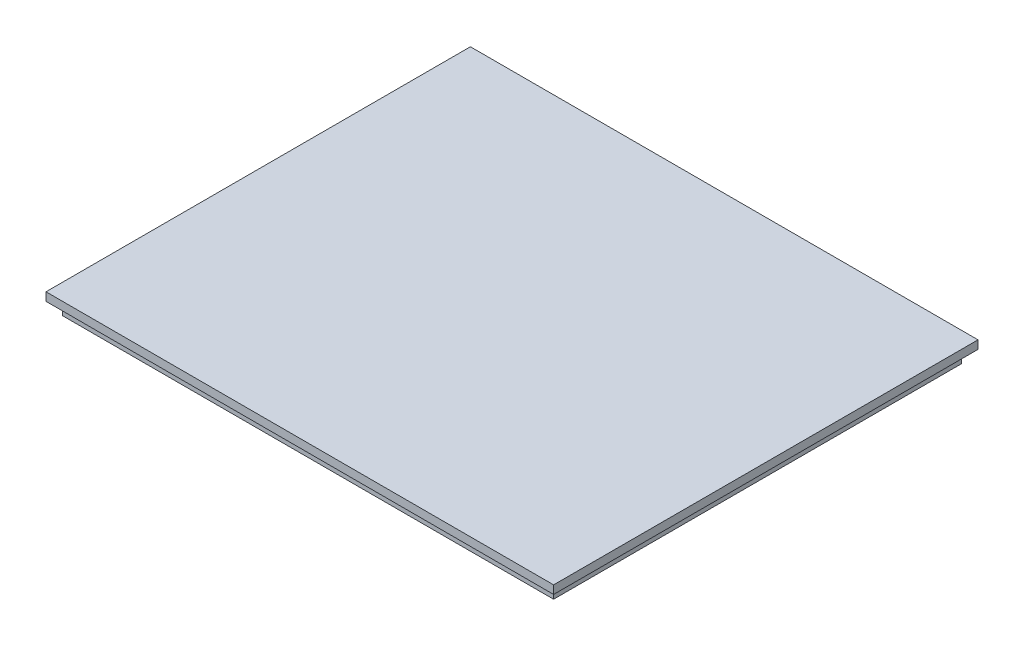
ISO-10303-21;
HEADER;
FILE_DESCRIPTION(('STEP AP214'),'2;1');
FILE_NAME('part.step','',(''),(''),'','','');
FILE_SCHEMA(('AUTOMOTIVE_DESIGN { 1 0 10303 214 1 1 1 1 }'));
ENDSEC;
DATA;
#1=APPLICATION_CONTEXT('core data for automotive mechanical design processes');
#2=APPLICATION_PROTOCOL_DEFINITION('international standard','automotive_design',2000,#1);
#3=PRODUCT_CONTEXT('',#1,'mechanical');
#4=PRODUCT('Part','Part','',(#3));
#5=PRODUCT_RELATED_PRODUCT_CATEGORY('part','',(#4));
#6=PRODUCT_DEFINITION_FORMATION('','',#4);
#7=PRODUCT_DEFINITION_CONTEXT('part definition',#1,'design');
#8=PRODUCT_DEFINITION('design','',#6,#7);
#9=PRODUCT_DEFINITION_SHAPE('','',#8);
#10=(LENGTH_UNIT() NAMED_UNIT(*) SI_UNIT(.MILLI.,.METRE.));
#11=(NAMED_UNIT(*) PLANE_ANGLE_UNIT() SI_UNIT($,.RADIAN.));
#12=(NAMED_UNIT(*) SI_UNIT($,.STERADIAN.) SOLID_ANGLE_UNIT());
#13=UNCERTAINTY_MEASURE_WITH_UNIT(LENGTH_MEASURE(1.E-05),#10,'distance_accuracy_value','');
#14=(GEOMETRIC_REPRESENTATION_CONTEXT(3) GLOBAL_UNCERTAINTY_ASSIGNED_CONTEXT((#13)) GLOBAL_UNIT_ASSIGNED_CONTEXT((#10,
#11,#12)) REPRESENTATION_CONTEXT('',''));
#15=CARTESIAN_POINT('',(0.,0.,0.));
#16=DIRECTION('',(0.,0.,1.));
#17=DIRECTION('',(1.,0.,0.));
#18=AXIS2_PLACEMENT_3D('',#15,#16,#17);
#19=CARTESIAN_POINT('',(67.4766734279919,88.2232812478183,-28.1135902636917));
#20=DIRECTION('',(0.,0.,1.));
#21=DIRECTION('',(1.,0.,0.));
#22=AXIS2_PLACEMENT_3D('',#19,#20,#21);
#23=PLANE('',#22);
#24=DIRECTION('',(-1.,0.,0.));
#25=VECTOR('',#24,1.);
#26=CARTESIAN_POINT('',(-54.5233265720081,85.2232812478183,-28.1135902636917));
#27=LINE('',#26,#25);
#28=CARTESIAN_POINT('',(67.4766734279919,85.2232812478183,-28.1135902636917));
#29=VERTEX_POINT('',#28);
#30=CARTESIAN_POINT('',(-54.5233265720081,85.2232812478183,-28.1135902636917));
#31=VERTEX_POINT('',#30);
#32=EDGE_CURVE('E176',#29,#31,#27,.T.);
#33=ORIENTED_EDGE('',*,*,#32,.F.);
#34=DIRECTION('',(0.,-1.,0.));
#35=VECTOR('',#34,1.);
#36=CARTESIAN_POINT('',(67.4766734279919,88.2232812478183,-28.1135902636917));
#37=LINE('',#36,#35);
#38=CARTESIAN_POINT('',(67.4766734279919,83.2232812478183,-28.1135902636917));
#39=VERTEX_POINT('',#38);
#40=EDGE_CURVE('E197',#29,#39,#37,.T.);
#41=ORIENTED_EDGE('',*,*,#40,.T.);
#42=DIRECTION('',(-1.,0.,0.));
#43=VECTOR('',#42,1.);
#44=CARTESIAN_POINT('',(67.4766734279919,83.2232812478183,-28.1135902636917));
#45=LINE('',#44,#43);
#46=CARTESIAN_POINT('',(-54.5233265720081,83.2232812478183,-28.1135902636917));
#47=VERTEX_POINT('',#46);
#48=EDGE_CURVE('E211',#39,#47,#45,.T.);
#49=ORIENTED_EDGE('',*,*,#48,.T.);
#50=DIRECTION('',(0.,-1.,0.));
#51=VECTOR('',#50,1.);
#52=CARTESIAN_POINT('',(-54.5233265720081,88.2232812478183,-28.1135902636917));
#53=LINE('',#52,#51);
#54=EDGE_CURVE('E11',#31,#47,#53,.T.);
#55=ORIENTED_EDGE('',*,*,#54,.F.);
#56=EDGE_LOOP('',(#33,#41,#49,#55));
#57=FACE_BOUND('',#56,.T.);
#58=ADVANCED_FACE('F39',(#57),#23,.F.);
#59=CARTESIAN_POINT('',(-54.5233265720081,88.2232812478183,-28.1135902636917));
#60=DIRECTION('',(1.,0.,0.));
#61=DIRECTION('',(0.,0.,-1.));
#62=AXIS2_PLACEMENT_3D('',#59,#60,#61);
#63=PLANE('',#62);
#64=DIRECTION('',(0.,0.,1.));
#65=VECTOR('',#64,1.);
#66=CARTESIAN_POINT('',(-54.5233265720081,85.2232812478183,-28.1135902636917));
#67=LINE('',#66,#65);
#68=CARTESIAN_POINT('',(-54.5233265720081,85.2232812478183,73.8864097363083));
#69=VERTEX_POINT('',#68);
#70=EDGE_CURVE('E173',#31,#69,#67,.T.);
#71=ORIENTED_EDGE('',*,*,#70,.F.);
#72=ORIENTED_EDGE('',*,*,#54,.T.);
#73=DIRECTION('',(0.,0.,1.));
#74=VECTOR('',#73,1.);
#75=CARTESIAN_POINT('',(-54.5233265720081,83.2232812478183,-28.1135902636917));
#76=LINE('',#75,#74);
#77=CARTESIAN_POINT('',(-54.5233265720081,83.2232812478183,73.8864097363083));
#78=VERTEX_POINT('',#77);
#79=EDGE_CURVE('E193',#47,#78,#76,.T.);
#80=ORIENTED_EDGE('',*,*,#79,.T.);
#81=DIRECTION('',(0.,-1.,0.));
#82=VECTOR('',#81,1.);
#83=CARTESIAN_POINT('',(-54.5233265720081,88.2232812478183,73.8864097363083));
#84=LINE('',#83,#82);
#85=EDGE_CURVE('E47',#69,#78,#84,.T.);
#86=ORIENTED_EDGE('',*,*,#85,.F.);
#87=EDGE_LOOP('',(#71,#72,#80,#86));
#88=FACE_BOUND('',#87,.T.);
#89=ADVANCED_FACE('F191',(#88),#63,.F.);
#90=CARTESIAN_POINT('',(-54.5233265720081,88.2232812478183,73.8864097363083));
#91=DIRECTION('',(0.,0.,-1.));
#92=DIRECTION('',(-1.,0.,0.));
#93=AXIS2_PLACEMENT_3D('',#90,#91,#92);
#94=PLANE('',#93);
#95=DIRECTION('',(1.,0.,0.));
#96=VECTOR('',#95,1.);
#97=CARTESIAN_POINT('',(-54.5233265720081,85.2232812478183,73.8864097363083));
#98=LINE('',#97,#96);
#99=CARTESIAN_POINT('',(67.4766734279919,85.2232812478183,73.8864097363083));
#100=VERTEX_POINT('',#99);
#101=EDGE_CURVE('E54',#69,#100,#98,.T.);
#102=ORIENTED_EDGE('',*,*,#101,.F.);
#103=ORIENTED_EDGE('',*,*,#85,.T.);
#104=DIRECTION('',(1.,0.,0.));
#105=VECTOR('',#104,1.);
#106=CARTESIAN_POINT('',(-54.5233265720081,83.2232812478183,73.8864097363083));
#107=LINE('',#106,#105);
#108=CARTESIAN_POINT('',(67.4766734279919,83.2232812478183,73.8864097363083));
#109=VERTEX_POINT('',#108);
#110=EDGE_CURVE('E206',#78,#109,#107,.T.);
#111=ORIENTED_EDGE('',*,*,#110,.T.);
#112=DIRECTION('',(0.,-1.,0.));
#113=VECTOR('',#112,1.);
#114=CARTESIAN_POINT('',(67.4766734279919,88.2232812478183,73.8864097363083));
#115=LINE('',#114,#113);
#116=EDGE_CURVE('E187',#100,#109,#115,.T.);
#117=ORIENTED_EDGE('',*,*,#116,.F.);
#118=EDGE_LOOP('',(#102,#103,#111,#117));
#119=FACE_BOUND('',#118,.T.);
#120=ADVANCED_FACE('F184',(#119),#94,.F.);
#121=CARTESIAN_POINT('',(67.4766734279919,88.2232812478183,73.8864097363083));
#122=DIRECTION('',(-1.,0.,0.));
#123=DIRECTION('',(0.,0.,1.));
#124=AXIS2_PLACEMENT_3D('',#121,#122,#123);
#125=PLANE('',#124);
#126=DIRECTION('',(0.,0.,-1.));
#127=VECTOR('',#126,1.);
#128=CARTESIAN_POINT('',(67.4766734279919,85.2232812478183,-28.1135902636917));
#129=LINE('',#128,#127);
#130=EDGE_CURVE('E189',#100,#29,#129,.T.);
#131=ORIENTED_EDGE('',*,*,#130,.F.);
#132=ORIENTED_EDGE('',*,*,#116,.T.);
#133=DIRECTION('',(0.,0.,-1.));
#134=VECTOR('',#133,1.);
#135=CARTESIAN_POINT('',(67.4766734279919,83.2232812478183,73.8864097363083));
#136=LINE('',#135,#134);
#137=EDGE_CURVE('E202',#109,#39,#136,.T.);
#138=ORIENTED_EDGE('',*,*,#137,.T.);
#139=ORIENTED_EDGE('',*,*,#40,.F.);
#140=EDGE_LOOP('',(#131,#132,#138,#139));
#141=FACE_BOUND('',#140,.T.);
#142=ADVANCED_FACE('F372',(#141),#125,.F.);
#143=CARTESIAN_POINT('',(0.,80.2232812478183,0.));
#144=DIRECTION('',(0.,-1.,0.));
#145=DIRECTION('',(0.,0.,-1.));
#146=AXIS2_PLACEMENT_3D('',#143,#144,#145);
#147=PLANE('',#146);
#148=DIRECTION('',(-1.,0.,0.));
#149=VECTOR('',#148,1.);
#150=CARTESIAN_POINT('',(67.4776734279919,80.2232812478183,-13.1135902636917));
#151=LINE('',#150,#149);
#152=CARTESIAN_POINT('',(-50.5233265720081,80.2232812478183,-13.1135902636917));
#153=VERTEX_POINT('',#152);
#154=CARTESIAN_POINT('',(-52.5233265720081,80.2232812478183,-13.1135902636917));
#155=VERTEX_POINT('',#154);
#156=EDGE_CURVE('E340',#153,#155,#151,.T.);
#157=ORIENTED_EDGE('',*,*,#156,.T.);
#158=DIRECTION('',(0.,0.,-1.));
#159=VECTOR('',#158,1.);
#160=CARTESIAN_POINT('',(-52.5233265720081,80.2232812478183,71.8864097363083));
#161=LINE('',#160,#159);
#162=CARTESIAN_POINT('',(-52.5233265720081,80.2232812478183,-26.1135902636917));
#163=VERTEX_POINT('',#162);
#164=EDGE_CURVE('E236',#155,#163,#161,.T.);
#165=ORIENTED_EDGE('',*,*,#164,.T.);
#166=DIRECTION('',(1.,0.,0.));
#167=VECTOR('',#166,1.);
#168=CARTESIAN_POINT('',(-52.5233265720081,80.2232812478183,-26.1135902636917));
#169=LINE('',#168,#167);
#170=CARTESIAN_POINT('',(65.4766734279919,80.2232812478183,-26.1135902636917));
#171=VERTEX_POINT('',#170);
#172=EDGE_CURVE('E256',#163,#171,#169,.T.);
#173=ORIENTED_EDGE('',*,*,#172,.T.);
#174=DIRECTION('',(0.,0.,1.));
#175=VECTOR('',#174,1.);
#176=CARTESIAN_POINT('',(65.4766734279919,80.2232812478183,-26.1135902636917));
#177=LINE('',#176,#175);
#178=CARTESIAN_POINT('',(65.4766734279919,80.2232812478183,71.8864097363083));
#179=VERTEX_POINT('',#178);
#180=EDGE_CURVE('E253',#171,#179,#177,.T.);
#181=ORIENTED_EDGE('',*,*,#180,.T.);
#182=DIRECTION('',(-1.,0.,0.));
#183=VECTOR('',#182,1.);
#184=CARTESIAN_POINT('',(65.4766734279919,80.2232812478183,71.8864097363083));
#185=LINE('',#184,#183);
#186=CARTESIAN_POINT('',(-52.5233265720081,80.2232812478183,71.8864097363083));
#187=VERTEX_POINT('',#186);
#188=EDGE_CURVE('E231',#179,#187,#185,.T.);
#189=ORIENTED_EDGE('',*,*,#188,.T.);
#190=CARTESIAN_POINT('',(-52.5233265720081,80.2232812478183,26.8864097363083));
#191=VERTEX_POINT('',#190);
#192=EDGE_CURVE('E259',#187,#191,#161,.T.);
#193=ORIENTED_EDGE('',*,*,#192,.T.);
#194=DIRECTION('',(-1.,0.,0.));
#195=VECTOR('',#194,1.);
#196=CARTESIAN_POINT('',(67.4776734279919,80.2232812478183,26.8864097363083));
#197=LINE('',#196,#195);
#198=CARTESIAN_POINT('',(-50.5233265720081,80.2232812478183,26.8864097363083));
#199=VERTEX_POINT('',#198);
#200=EDGE_CURVE('E317',#199,#191,#197,.T.);
#201=ORIENTED_EDGE('',*,*,#200,.F.);
#202=DIRECTION('',(0.,0.,-1.));
#203=VECTOR('',#202,1.);
#204=CARTESIAN_POINT('',(-50.5233265720081,80.2232812478183,71.8864097363083));
#205=LINE('',#204,#203);
#206=CARTESIAN_POINT('',(-50.5233265720081,80.2232812478183,69.8864097363083));
#207=VERTEX_POINT('',#206);
#208=EDGE_CURVE('E306',#207,#199,#205,.T.);
#209=ORIENTED_EDGE('',*,*,#208,.F.);
#210=DIRECTION('',(-1.,0.,0.));
#211=VECTOR('',#210,1.);
#212=CARTESIAN_POINT('',(65.4766734279919,80.2232812478183,69.8864097363083));
#213=LINE('',#212,#211);
#214=CARTESIAN_POINT('',(63.4766734279919,80.2232812478183,69.8864097363083));
#215=VERTEX_POINT('',#214);
#216=EDGE_CURVE('E277',#215,#207,#213,.T.);
#217=ORIENTED_EDGE('',*,*,#216,.F.);
#218=DIRECTION('',(0.,0.,1.));
#219=VECTOR('',#218,1.);
#220=CARTESIAN_POINT('',(63.4766734279919,80.2232812478183,-26.1135902636917));
#221=LINE('',#220,#219);
#222=CARTESIAN_POINT('',(63.4766734279919,80.2232812478183,-24.1135902636917));
#223=VERTEX_POINT('',#222);
#224=EDGE_CURVE('E299',#223,#215,#221,.T.);
#225=ORIENTED_EDGE('',*,*,#224,.F.);
#226=DIRECTION('',(1.,0.,0.));
#227=VECTOR('',#226,1.);
#228=CARTESIAN_POINT('',(-52.5233265720081,80.2232812478183,-24.1135902636917));
#229=LINE('',#228,#227);
#230=CARTESIAN_POINT('',(-50.5233265720081,80.2232812478183,-24.1135902636917));
#231=VERTEX_POINT('',#230);
#232=EDGE_CURVE('E303',#231,#223,#229,.T.);
#233=ORIENTED_EDGE('',*,*,#232,.F.);
#234=EDGE_CURVE('E282',#153,#231,#205,.T.);
#235=ORIENTED_EDGE('',*,*,#234,.F.);
#236=EDGE_LOOP('',(#157,#165,#173,#181,#189,#193,#201,#209,#217,#225,#233,#235));
#237=FACE_BOUND('',#236,.T.);
#238=ADVANCED_FACE('F403',(#237),#147,.T.);
#239=CARTESIAN_POINT('',(-52.5233265720081,80.2232812478183,71.8864097363083));
#240=DIRECTION('',(1.,0.,0.));
#241=DIRECTION('',(0.,0.,-1.));
#242=AXIS2_PLACEMENT_3D('',#239,#240,#241);
#243=PLANE('',#242);
#244=ORIENTED_EDGE('',*,*,#164,.F.);
#245=DIRECTION('',(0.,-1.,0.));
#246=VECTOR('',#245,1.);
#247=CARTESIAN_POINT('',(-52.5233265720081,80.2232812478183,-13.1135902636917));
#248=LINE('',#247,#246);
#249=CARTESIAN_POINT('',(-52.5233265720081,83.2232812478183,-13.1135902636917));
#250=VERTEX_POINT('',#249);
#251=EDGE_CURVE('E347',#250,#155,#248,.T.);
#252=ORIENTED_EDGE('',*,*,#251,.F.);
#253=DIRECTION('',(0.,0.,-1.));
#254=VECTOR('',#253,1.);
#255=CARTESIAN_POINT('',(-52.5233265720081,83.2232812478183,71.8864097363083));
#256=LINE('',#255,#254);
#257=CARTESIAN_POINT('',(-52.5233265720081,83.2232812478183,-26.1135902636917));
#258=VERTEX_POINT('',#257);
#259=EDGE_CURVE('E250',#250,#258,#256,.T.);
#260=ORIENTED_EDGE('',*,*,#259,.T.);
#261=DIRECTION('',(0.,1.,0.));
#262=VECTOR('',#261,1.);
#263=CARTESIAN_POINT('',(-52.5233265720081,80.2232812478183,-26.1135902636917));
#264=LINE('',#263,#262);
#265=EDGE_CURVE('E215',#163,#258,#264,.T.);
#266=ORIENTED_EDGE('',*,*,#265,.F.);
#267=EDGE_LOOP('',(#244,#252,#260,#266));
#268=FACE_BOUND('',#267,.T.);
#269=ADVANCED_FACE('F407',(#268),#243,.F.);
#270=CARTESIAN_POINT('',(-52.5233265720081,83.2232812478183,15.8864097363083));
#271=VERTEX_POINT('',#270);
#272=CARTESIAN_POINT('',(-52.5233265720081,83.2232812478183,5.88640973630832));
#273=VERTEX_POINT('',#272);
#274=EDGE_CURVE('E249',#271,#273,#256,.T.);
#275=ORIENTED_EDGE('',*,*,#274,.T.);
#276=DIRECTION('',(0.,1.,0.));
#277=VECTOR('',#276,1.);
#278=CARTESIAN_POINT('',(-52.5233265720081,80.2232812478183,5.88640973630832));
#279=LINE('',#278,#277);
#280=CARTESIAN_POINT('',(-52.5233265720081,80.2232812478183,5.88640973630832));
#281=VERTEX_POINT('',#280);
#282=EDGE_CURVE('E362',#281,#273,#279,.T.);
#283=ORIENTED_EDGE('',*,*,#282,.F.);
#284=CARTESIAN_POINT('',(-52.5233265720081,80.2232812478183,15.8864097363083));
#285=VERTEX_POINT('',#284);
#286=EDGE_CURVE('E263',#285,#281,#161,.T.);
#287=ORIENTED_EDGE('',*,*,#286,.F.);
#288=DIRECTION('',(0.,-1.,0.));
#289=VECTOR('',#288,1.);
#290=CARTESIAN_POINT('',(-52.5233265720081,80.2232812478183,15.8864097363083));
#291=LINE('',#290,#289);
#292=EDGE_CURVE('E320',#271,#285,#291,.T.);
#293=ORIENTED_EDGE('',*,*,#292,.F.);
#294=EDGE_LOOP('',(#275,#283,#287,#293));
#295=FACE_BOUND('',#294,.T.);
#296=ADVANCED_FACE('F414',(#295),#243,.F.);
#297=CARTESIAN_POINT('',(-50.5233265720081,80.2232812478183,71.8864097363083));
#298=DIRECTION('',(1.,0.,0.));
#299=DIRECTION('',(0.,0.,-1.));
#300=AXIS2_PLACEMENT_3D('',#297,#298,#299);
#301=PLANE('',#300);
#302=DIRECTION('',(0.,-1.,0.));
#303=VECTOR('',#302,1.);
#304=CARTESIAN_POINT('',(-50.5233265720081,80.2232812478183,-13.1135902636917));
#305=LINE('',#304,#303);
#306=CARTESIAN_POINT('',(-50.5233265720081,83.2232812478183,-13.1135902636917));
#307=VERTEX_POINT('',#306);
#308=EDGE_CURVE('E339',#307,#153,#305,.T.);
#309=ORIENTED_EDGE('',*,*,#308,.T.);
#310=ORIENTED_EDGE('',*,*,#234,.T.);
#311=DIRECTION('',(0.,1.,0.));
#312=VECTOR('',#311,1.);
#313=CARTESIAN_POINT('',(-50.5233265720081,80.2232812478183,-24.1135902636917));
#314=LINE('',#313,#312);
#315=CARTESIAN_POINT('',(-50.5233265720081,83.2232812478183,-24.1135902636917));
#316=VERTEX_POINT('',#315);
#317=EDGE_CURVE('E264',#231,#316,#314,.T.);
#318=ORIENTED_EDGE('',*,*,#317,.T.);
#319=DIRECTION('',(0.,0.,-1.));
#320=VECTOR('',#319,1.);
#321=CARTESIAN_POINT('',(-50.5233265720081,83.2232812478183,71.8864097363083));
#322=LINE('',#321,#320);
#323=EDGE_CURVE('E296',#307,#316,#322,.T.);
#324=ORIENTED_EDGE('',*,*,#323,.F.);
#325=EDGE_LOOP('',(#309,#310,#318,#324));
#326=FACE_BOUND('',#325,.T.);
#327=ADVANCED_FACE('F428',(#326),#301,.T.);
#328=DIRECTION('',(0.,1.,0.));
#329=VECTOR('',#328,1.);
#330=CARTESIAN_POINT('',(-50.5233265720081,80.2232812478183,5.88640973630832));
#331=LINE('',#330,#329);
#332=CARTESIAN_POINT('',(-50.5233265720081,80.2232812478183,5.88640973630832));
#333=VERTEX_POINT('',#332);
#334=CARTESIAN_POINT('',(-50.5233265720081,83.2232812478183,5.88640973630832));
#335=VERTEX_POINT('',#334);
#336=EDGE_CURVE('E351',#333,#335,#331,.T.);
#337=ORIENTED_EDGE('',*,*,#336,.T.);
#338=CARTESIAN_POINT('',(-50.5233265720081,83.2232812478183,15.8864097363083));
#339=VERTEX_POINT('',#338);
#340=EDGE_CURVE('E295',#339,#335,#322,.T.);
#341=ORIENTED_EDGE('',*,*,#340,.F.);
#342=DIRECTION('',(0.,-1.,0.));
#343=VECTOR('',#342,1.);
#344=CARTESIAN_POINT('',(-50.5233265720081,80.2232812478183,15.8864097363083));
#345=LINE('',#344,#343);
#346=CARTESIAN_POINT('',(-50.5233265720081,80.2232812478183,15.8864097363083));
#347=VERTEX_POINT('',#346);
#348=EDGE_CURVE('E316',#339,#347,#345,.T.);
#349=ORIENTED_EDGE('',*,*,#348,.T.);
#350=EDGE_CURVE('E310',#347,#333,#205,.T.);
#351=ORIENTED_EDGE('',*,*,#350,.T.);
#352=EDGE_LOOP('',(#337,#341,#349,#351));
#353=FACE_BOUND('',#352,.T.);
#354=ADVANCED_FACE('F420',(#353),#301,.T.);
#355=DIRECTION('',(-1.,0.,0.));
#356=VECTOR('',#355,1.);
#357=CARTESIAN_POINT('',(67.4776734279919,80.2232812478183,5.88640973630831));
#358=LINE('',#357,#356);
#359=EDGE_CURVE('E344',#333,#281,#358,.T.);
#360=ORIENTED_EDGE('',*,*,#359,.F.);
#361=ORIENTED_EDGE('',*,*,#350,.F.);
#362=DIRECTION('',(-1.,0.,0.));
#363=VECTOR('',#362,1.);
#364=CARTESIAN_POINT('',(67.4776734279919,80.2232812478183,15.8864097363083));
#365=LINE('',#364,#363);
#366=EDGE_CURVE('E311',#347,#285,#365,.T.);
#367=ORIENTED_EDGE('',*,*,#366,.T.);
#368=ORIENTED_EDGE('',*,*,#286,.T.);
#369=EDGE_LOOP('',(#360,#361,#367,#368));
#370=FACE_BOUND('',#369,.T.);
#371=ADVANCED_FACE('F410',(#370),#147,.T.);
#372=CARTESIAN_POINT('',(-52.5233265720081,83.2232812478183,71.8864097363083));
#373=VERTEX_POINT('',#372);
#374=CARTESIAN_POINT('',(-52.5233265720081,83.2232812478183,26.8864097363083));
#375=VERTEX_POINT('',#374);
#376=EDGE_CURVE('E245',#373,#375,#256,.T.);
#377=ORIENTED_EDGE('',*,*,#376,.T.);
#378=DIRECTION('',(0.,1.,0.));
#379=VECTOR('',#378,1.);
#380=CARTESIAN_POINT('',(-52.5233265720081,80.2232812478183,26.8864097363083));
#381=LINE('',#380,#379);
#382=EDGE_CURVE('E335',#191,#375,#381,.T.);
#383=ORIENTED_EDGE('',*,*,#382,.F.);
#384=ORIENTED_EDGE('',*,*,#192,.F.);
#385=DIRECTION('',(0.,1.,0.));
#386=VECTOR('',#385,1.);
#387=CARTESIAN_POINT('',(-52.5233265720081,80.2232812478183,71.8864097363083));
#388=LINE('',#387,#386);
#389=EDGE_CURVE('E227',#187,#373,#388,.T.);
#390=ORIENTED_EDGE('',*,*,#389,.T.);
#391=EDGE_LOOP('',(#377,#383,#384,#390));
#392=FACE_BOUND('',#391,.T.);
#393=ADVANCED_FACE('F416',(#392),#243,.F.);
#394=CARTESIAN_POINT('',(-52.5233265720081,80.2232812478183,-26.1135902636917));
#395=DIRECTION('',(0.,0.,1.));
#396=DIRECTION('',(1.,0.,0.));
#397=AXIS2_PLACEMENT_3D('',#394,#395,#396);
#398=PLANE('',#397);
#399=DIRECTION('',(1.,0.,0.));
#400=VECTOR('',#399,1.);
#401=CARTESIAN_POINT('',(-52.5233265720081,83.2232812478183,-26.1135902636917));
#402=LINE('',#401,#400);
#403=CARTESIAN_POINT('',(65.4766734279919,83.2232812478183,-26.1135902636917));
#404=VERTEX_POINT('',#403);
#405=EDGE_CURVE('E241',#258,#404,#402,.T.);
#406=ORIENTED_EDGE('',*,*,#405,.T.);
#407=DIRECTION('',(0.,1.,0.));
#408=VECTOR('',#407,1.);
#409=CARTESIAN_POINT('',(65.4766734279919,80.2232812478183,-26.1135902636917));
#410=LINE('',#409,#408);
#411=EDGE_CURVE('E219',#171,#404,#410,.T.);
#412=ORIENTED_EDGE('',*,*,#411,.F.);
#413=ORIENTED_EDGE('',*,*,#172,.F.);
#414=ORIENTED_EDGE('',*,*,#265,.T.);
#415=EDGE_LOOP('',(#406,#412,#413,#414));
#416=FACE_BOUND('',#415,.T.);
#417=ADVANCED_FACE('F426',(#416),#398,.F.);
#418=CARTESIAN_POINT('',(65.4766734279919,80.2232812478183,-26.1135902636917));
#419=DIRECTION('',(-1.,0.,0.));
#420=DIRECTION('',(0.,0.,1.));
#421=AXIS2_PLACEMENT_3D('',#418,#419,#420);
#422=PLANE('',#421);
#423=DIRECTION('',(0.,0.,1.));
#424=VECTOR('',#423,1.);
#425=CARTESIAN_POINT('',(65.4766734279919,83.2232812478183,-26.1135902636917));
#426=LINE('',#425,#424);
#427=CARTESIAN_POINT('',(65.4766734279919,83.2232812478183,71.8864097363083));
#428=VERTEX_POINT('',#427);
#429=EDGE_CURVE('E237',#404,#428,#426,.T.);
#430=ORIENTED_EDGE('',*,*,#429,.T.);
#431=DIRECTION('',(0.,1.,0.));
#432=VECTOR('',#431,1.);
#433=CARTESIAN_POINT('',(65.4766734279919,80.2232812478183,71.8864097363083));
#434=LINE('',#433,#432);
#435=EDGE_CURVE('E223',#179,#428,#434,.T.);
#436=ORIENTED_EDGE('',*,*,#435,.F.);
#437=ORIENTED_EDGE('',*,*,#180,.F.);
#438=ORIENTED_EDGE('',*,*,#411,.T.);
#439=EDGE_LOOP('',(#430,#436,#437,#438));
#440=FACE_BOUND('',#439,.T.);
#441=ADVANCED_FACE('F476',(#440),#422,.F.);
#442=CARTESIAN_POINT('',(65.4766734279919,80.2232812478183,71.8864097363083));
#443=DIRECTION('',(0.,0.,-1.));
#444=DIRECTION('',(-1.,0.,0.));
#445=AXIS2_PLACEMENT_3D('',#442,#443,#444);
#446=PLANE('',#445);
#447=DIRECTION('',(-1.,0.,0.));
#448=VECTOR('',#447,1.);
#449=CARTESIAN_POINT('',(65.4766734279919,83.2232812478183,71.8864097363083));
#450=LINE('',#449,#448);
#451=EDGE_CURVE('E232',#428,#373,#450,.T.);
#452=ORIENTED_EDGE('',*,*,#451,.T.);
#453=ORIENTED_EDGE('',*,*,#389,.F.);
#454=ORIENTED_EDGE('',*,*,#188,.F.);
#455=ORIENTED_EDGE('',*,*,#435,.T.);
#456=EDGE_LOOP('',(#452,#453,#454,#455));
#457=FACE_BOUND('',#456,.T.);
#458=ADVANCED_FACE('F483',(#457),#446,.F.);
#459=DIRECTION('',(0.,1.,0.));
#460=VECTOR('',#459,1.);
#461=CARTESIAN_POINT('',(-50.5233265720081,80.2232812478183,26.8864097363083));
#462=LINE('',#461,#460);
#463=CARTESIAN_POINT('',(-50.5233265720081,83.2232812478183,26.8864097363083));
#464=VERTEX_POINT('',#463);
#465=EDGE_CURVE('E324',#199,#464,#462,.T.);
#466=ORIENTED_EDGE('',*,*,#465,.T.);
#467=CARTESIAN_POINT('',(-50.5233265720081,83.2232812478183,69.8864097363083));
#468=VERTEX_POINT('',#467);
#469=EDGE_CURVE('E291',#468,#464,#322,.T.);
#470=ORIENTED_EDGE('',*,*,#469,.F.);
#471=DIRECTION('',(0.,1.,0.));
#472=VECTOR('',#471,1.);
#473=CARTESIAN_POINT('',(-50.5233265720081,80.2232812478183,69.8864097363083));
#474=LINE('',#473,#472);
#475=EDGE_CURVE('E274',#207,#468,#474,.T.);
#476=ORIENTED_EDGE('',*,*,#475,.F.);
#477=ORIENTED_EDGE('',*,*,#208,.T.);
#478=EDGE_LOOP('',(#466,#470,#476,#477));
#479=FACE_BOUND('',#478,.T.);
#480=ADVANCED_FACE('F430',(#479),#301,.T.);
#481=CARTESIAN_POINT('',(-52.5233265720081,80.2232812478183,-24.1135902636917));
#482=DIRECTION('',(0.,0.,1.));
#483=DIRECTION('',(1.,0.,0.));
#484=AXIS2_PLACEMENT_3D('',#481,#482,#483);
#485=PLANE('',#484);
#486=DIRECTION('',(1.,0.,0.));
#487=VECTOR('',#486,1.);
#488=CARTESIAN_POINT('',(-52.5233265720081,83.2232812478183,-24.1135902636917));
#489=LINE('',#488,#487);
#490=CARTESIAN_POINT('',(63.4766734279919,83.2232812478183,-24.1135902636917));
#491=VERTEX_POINT('',#490);
#492=EDGE_CURVE('E287',#316,#491,#489,.T.);
#493=ORIENTED_EDGE('',*,*,#492,.F.);
#494=ORIENTED_EDGE('',*,*,#317,.F.);
#495=ORIENTED_EDGE('',*,*,#232,.T.);
#496=DIRECTION('',(0.,1.,0.));
#497=VECTOR('',#496,1.);
#498=CARTESIAN_POINT('',(63.4766734279919,80.2232812478183,-24.1135902636917));
#499=LINE('',#498,#497);
#500=EDGE_CURVE('E268',#223,#491,#499,.T.);
#501=ORIENTED_EDGE('',*,*,#500,.T.);
#502=EDGE_LOOP('',(#493,#494,#495,#501));
#503=FACE_BOUND('',#502,.T.);
#504=ADVANCED_FACE('F450',(#503),#485,.T.);
#505=CARTESIAN_POINT('',(63.4766734279919,80.2232812478183,-26.1135902636917));
#506=DIRECTION('',(-1.,0.,0.));
#507=DIRECTION('',(0.,0.,1.));
#508=AXIS2_PLACEMENT_3D('',#505,#506,#507);
#509=PLANE('',#508);
#510=DIRECTION('',(0.,0.,1.));
#511=VECTOR('',#510,1.);
#512=CARTESIAN_POINT('',(63.4766734279919,83.2232812478183,-26.1135902636917));
#513=LINE('',#512,#511);
#514=CARTESIAN_POINT('',(63.4766734279919,83.2232812478183,69.8864097363083));
#515=VERTEX_POINT('',#514);
#516=EDGE_CURVE('E283',#491,#515,#513,.T.);
#517=ORIENTED_EDGE('',*,*,#516,.F.);
#518=ORIENTED_EDGE('',*,*,#500,.F.);
#519=ORIENTED_EDGE('',*,*,#224,.T.);
#520=DIRECTION('',(0.,1.,0.));
#521=VECTOR('',#520,1.);
#522=CARTESIAN_POINT('',(63.4766734279919,80.2232812478183,69.8864097363083));
#523=LINE('',#522,#521);
#524=EDGE_CURVE('E271',#215,#515,#523,.T.);
#525=ORIENTED_EDGE('',*,*,#524,.T.);
#526=EDGE_LOOP('',(#517,#518,#519,#525));
#527=FACE_BOUND('',#526,.T.);
#528=ADVANCED_FACE('F388',(#527),#509,.T.);
#529=CARTESIAN_POINT('',(65.4766734279919,80.2232812478183,69.8864097363083));
#530=DIRECTION('',(0.,0.,-1.));
#531=DIRECTION('',(-1.,0.,0.));
#532=AXIS2_PLACEMENT_3D('',#529,#530,#531);
#533=PLANE('',#532);
#534=DIRECTION('',(-1.,0.,0.));
#535=VECTOR('',#534,1.);
#536=CARTESIAN_POINT('',(65.4766734279919,83.2232812478183,69.8864097363083));
#537=LINE('',#536,#535);
#538=EDGE_CURVE('E278',#515,#468,#537,.T.);
#539=ORIENTED_EDGE('',*,*,#538,.F.);
#540=ORIENTED_EDGE('',*,*,#524,.F.);
#541=ORIENTED_EDGE('',*,*,#216,.T.);
#542=ORIENTED_EDGE('',*,*,#475,.T.);
#543=EDGE_LOOP('',(#539,#540,#541,#542));
#544=FACE_BOUND('',#543,.T.);
#545=ADVANCED_FACE('F379',(#544),#533,.T.);
#546=CARTESIAN_POINT('',(0.,83.2232812478183,0.));
#547=DIRECTION('',(0.,1.,0.));
#548=DIRECTION('',(0.,0.,1.));
#549=AXIS2_PLACEMENT_3D('',#546,#547,#548);
#550=PLANE('',#549);
#551=ORIENTED_EDGE('',*,*,#259,.F.);
#552=DIRECTION('',(-1.,0.,0.));
#553=VECTOR('',#552,1.);
#554=CARTESIAN_POINT('',(67.4776734279919,83.2232812478183,-13.1135902636917));
#555=LINE('',#554,#553);
#556=EDGE_CURVE('E62',#307,#250,#555,.T.);
#557=ORIENTED_EDGE('',*,*,#556,.F.);
#558=ORIENTED_EDGE('',*,*,#323,.T.);
#559=ORIENTED_EDGE('',*,*,#492,.T.);
#560=ORIENTED_EDGE('',*,*,#516,.T.);
#561=ORIENTED_EDGE('',*,*,#538,.T.);
#562=ORIENTED_EDGE('',*,*,#469,.T.);
#563=DIRECTION('',(-1.,0.,0.));
#564=VECTOR('',#563,1.);
#565=CARTESIAN_POINT('',(67.4776734279919,83.2232812478183,26.8864097363083));
#566=LINE('',#565,#564);
#567=EDGE_CURVE('E321',#464,#375,#566,.T.);
#568=ORIENTED_EDGE('',*,*,#567,.T.);
#569=ORIENTED_EDGE('',*,*,#376,.F.);
#570=ORIENTED_EDGE('',*,*,#451,.F.);
#571=ORIENTED_EDGE('',*,*,#429,.F.);
#572=ORIENTED_EDGE('',*,*,#405,.F.);
#573=EDGE_LOOP('',(#551,#557,#558,#559,#560,#561,#562,#568,#569,#570,#571,#572));
#574=FACE_BOUND('',#573,.T.);
#575=DIRECTION('',(-1.,0.,0.));
#576=VECTOR('',#575,1.);
#577=CARTESIAN_POINT('',(67.4776734279919,83.2232812478183,5.88640973630831));
#578=LINE('',#577,#576);
#579=EDGE_CURVE('E348',#335,#273,#578,.T.);
#580=ORIENTED_EDGE('',*,*,#579,.T.);
#581=ORIENTED_EDGE('',*,*,#274,.F.);
#582=DIRECTION('',(-1.,0.,0.));
#583=VECTOR('',#582,1.);
#584=CARTESIAN_POINT('',(67.4776734279919,83.2232812478183,15.8864097363083));
#585=LINE('',#584,#583);
#586=EDGE_CURVE('E315',#339,#271,#585,.T.);
#587=ORIENTED_EDGE('',*,*,#586,.F.);
#588=ORIENTED_EDGE('',*,*,#340,.T.);
#589=EDGE_LOOP('',(#580,#581,#587,#588));
#590=FACE_BOUND('',#589,.T.);
#591=ORIENTED_EDGE('',*,*,#48,.F.);
#592=ORIENTED_EDGE('',*,*,#137,.F.);
#593=ORIENTED_EDGE('',*,*,#110,.F.);
#594=ORIENTED_EDGE('',*,*,#79,.F.);
#595=EDGE_LOOP('',(#591,#592,#593,#594));
#596=FACE_BOUND('',#595,.T.);
#597=ADVANCED_FACE('F376',(#574,#590,#596),#550,.F.);
#598=CARTESIAN_POINT('',(67.4776734279919,80.2232812478183,15.8864097363083));
#599=DIRECTION('',(0.,0.,-1.));
#600=DIRECTION('',(-1.,0.,0.));
#601=AXIS2_PLACEMENT_3D('',#598,#599,#600);
#602=PLANE('',#601);
#603=ORIENTED_EDGE('',*,*,#586,.T.);
#604=ORIENTED_EDGE('',*,*,#292,.T.);
#605=ORIENTED_EDGE('',*,*,#366,.F.);
#606=ORIENTED_EDGE('',*,*,#348,.F.);
#607=EDGE_LOOP('',(#603,#604,#605,#606));
#608=FACE_BOUND('',#607,.T.);
#609=ADVANCED_FACE('F378',(#608),#602,.F.);
#610=CARTESIAN_POINT('',(67.4776734279919,80.2232812478183,26.8864097363083));
#611=DIRECTION('',(0.,0.,1.));
#612=DIRECTION('',(1.,0.,0.));
#613=AXIS2_PLACEMENT_3D('',#610,#611,#612);
#614=PLANE('',#613);
#615=ORIENTED_EDGE('',*,*,#200,.T.);
#616=ORIENTED_EDGE('',*,*,#382,.T.);
#617=ORIENTED_EDGE('',*,*,#567,.F.);
#618=ORIENTED_EDGE('',*,*,#465,.F.);
#619=EDGE_LOOP('',(#615,#616,#617,#618));
#620=FACE_BOUND('',#619,.T.);
#621=ADVANCED_FACE('F385',(#620),#614,.F.);
#622=CARTESIAN_POINT('',(67.4776734279919,80.2232812478183,-13.1135902636917));
#623=DIRECTION('',(0.,0.,-1.));
#624=DIRECTION('',(-1.,0.,0.));
#625=AXIS2_PLACEMENT_3D('',#622,#623,#624);
#626=PLANE('',#625);
#627=ORIENTED_EDGE('',*,*,#556,.T.);
#628=ORIENTED_EDGE('',*,*,#251,.T.);
#629=ORIENTED_EDGE('',*,*,#156,.F.);
#630=ORIENTED_EDGE('',*,*,#308,.F.);
#631=EDGE_LOOP('',(#627,#628,#629,#630));
#632=FACE_BOUND('',#631,.T.);
#633=ADVANCED_FACE('F605',(#632),#626,.F.);
#634=CARTESIAN_POINT('',(67.4776734279919,80.2232812478183,5.88640973630831));
#635=DIRECTION('',(0.,0.,1.));
#636=DIRECTION('',(0.,-1.,0.));
#637=AXIS2_PLACEMENT_3D('',#634,#635,#636);
#638=PLANE('',#637);
#639=ORIENTED_EDGE('',*,*,#359,.T.);
#640=ORIENTED_EDGE('',*,*,#282,.T.);
#641=ORIENTED_EDGE('',*,*,#579,.F.);
#642=ORIENTED_EDGE('',*,*,#336,.F.);
#643=EDGE_LOOP('',(#639,#640,#641,#642));
#644=FACE_BOUND('',#643,.T.);
#645=ADVANCED_FACE('F613',(#644),#638,.F.);
#646=CARTESIAN_POINT('',(0.,85.2232812478183,0.));
#647=DIRECTION('',(0.,1.,0.));
#648=DIRECTION('',(0.,0.,1.));
#649=AXIS2_PLACEMENT_3D('',#646,#647,#648);
#650=PLANE('',#649);
#651=ORIENTED_EDGE('',*,*,#70,.T.);
#652=ORIENTED_EDGE('',*,*,#101,.T.);
#653=ORIENTED_EDGE('',*,*,#130,.T.);
#654=ORIENTED_EDGE('',*,*,#32,.T.);
#655=EDGE_LOOP('',(#651,#652,#653,#654));
#656=FACE_BOUND('',#655,.T.);
#657=ADVANCED_FACE('F174',(#656),#650,.T.);
#658=CLOSED_SHELL('',(#58,#89,#120,#142,#238,#269,#296,#327,#354,#371,#393,#417,#441,#458,#480,
#504,#528,#545,#597,#609,#621,#633,#645,#657));
#659=MANIFOLD_SOLID_BREP('B2',#658);
#660=ADVANCED_BREP_SHAPE_REPRESENTATION('',(#18,#659),#14);
#661=SHAPE_DEFINITION_REPRESENTATION(#9,#660);
ENDSEC;
END-ISO-10303-21;
